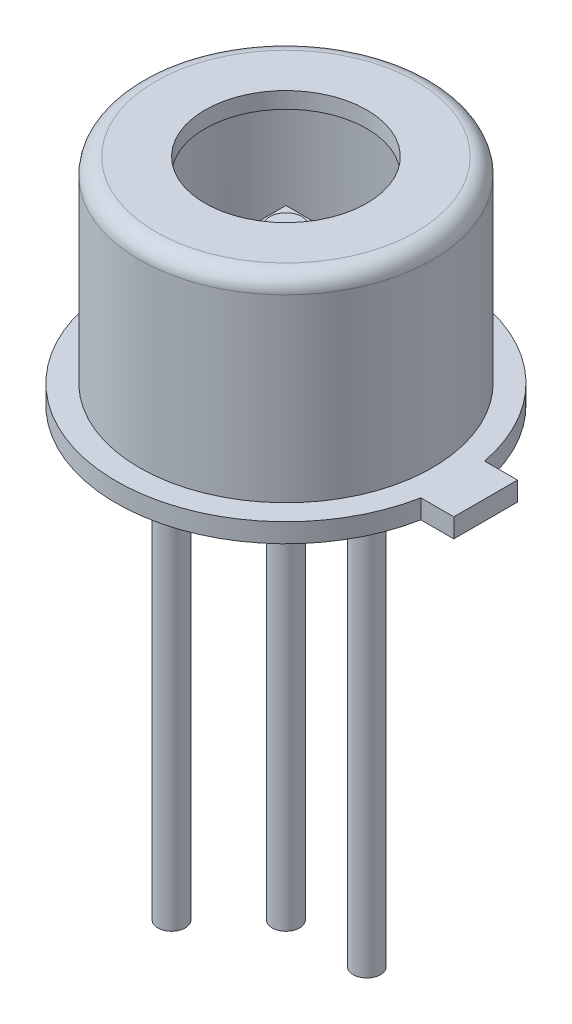
ISO-10303-21;
HEADER;
FILE_DESCRIPTION(('STEP AP214'),'2;1');
FILE_NAME('part.step','',(''),(''),'','','');
FILE_SCHEMA(('AUTOMOTIVE_DESIGN { 1 0 10303 214 1 1 1 1 }'));
ENDSEC;
DATA;
#1=APPLICATION_CONTEXT('core data for automotive mechanical design processes');
#2=APPLICATION_PROTOCOL_DEFINITION('international standard','automotive_design',2000,#1);
#3=PRODUCT_CONTEXT('',#1,'mechanical');
#4=PRODUCT('Part','Part','',(#3));
#5=PRODUCT_RELATED_PRODUCT_CATEGORY('part','',(#4));
#6=PRODUCT_DEFINITION_FORMATION('','',#4);
#7=PRODUCT_DEFINITION_CONTEXT('part definition',#1,'design');
#8=PRODUCT_DEFINITION('design','',#6,#7);
#9=PRODUCT_DEFINITION_SHAPE('','',#8);
#10=(LENGTH_UNIT() NAMED_UNIT(*) SI_UNIT(.MILLI.,.METRE.));
#11=(NAMED_UNIT(*) PLANE_ANGLE_UNIT() SI_UNIT($,.RADIAN.));
#12=(NAMED_UNIT(*) SI_UNIT($,.STERADIAN.) SOLID_ANGLE_UNIT());
#13=UNCERTAINTY_MEASURE_WITH_UNIT(LENGTH_MEASURE(1.E-05),#10,'distance_accuracy_value','');
#14=(GEOMETRIC_REPRESENTATION_CONTEXT(3) GLOBAL_UNCERTAINTY_ASSIGNED_CONTEXT((#13)) GLOBAL_UNIT_ASSIGNED_CONTEXT((#10,
#11,#12)) REPRESENTATION_CONTEXT('',''));
#15=CARTESIAN_POINT('',(0.,0.,0.));
#16=DIRECTION('',(0.,0.,1.));
#17=DIRECTION('',(1.,0.,0.));
#18=AXIS2_PLACEMENT_3D('',#15,#16,#17);
#19=CARTESIAN_POINT('',(-0.375,2.34,-0.375));
#20=DIRECTION('',(0.,-1.,0.));
#21=DIRECTION('',(0.,0.,-1.));
#22=AXIS2_PLACEMENT_3D('',#19,#20,#21);
#23=PLANE('',#22);
#24=DIRECTION('',(0.,0.,-1.));
#25=VECTOR('',#24,1.);
#26=CARTESIAN_POINT('',(-0.375,2.34,0.375));
#27=LINE('',#26,#25);
#28=CARTESIAN_POINT('',(-0.375,2.34,0.375));
#29=VERTEX_POINT('',#28);
#30=CARTESIAN_POINT('',(-0.375,2.34,-0.375));
#31=VERTEX_POINT('',#30);
#32=EDGE_CURVE('E111',#29,#31,#27,.T.);
#33=ORIENTED_EDGE('',*,*,#32,.F.);
#34=DIRECTION('',(-1.,0.,0.));
#35=VECTOR('',#34,1.);
#36=CARTESIAN_POINT('',(-0.375,2.34,0.375));
#37=LINE('',#36,#35);
#38=CARTESIAN_POINT('',(0.375,2.34,0.375));
#39=VERTEX_POINT('',#38);
#40=EDGE_CURVE('E84',#39,#29,#37,.T.);
#41=ORIENTED_EDGE('',*,*,#40,.F.);
#42=DIRECTION('',(0.,0.,1.));
#43=VECTOR('',#42,1.);
#44=CARTESIAN_POINT('',(0.375,2.34,0.375));
#45=LINE('',#44,#43);
#46=CARTESIAN_POINT('',(0.375,2.34,-0.375));
#47=VERTEX_POINT('',#46);
#48=EDGE_CURVE('E78',#47,#39,#45,.T.);
#49=ORIENTED_EDGE('',*,*,#48,.F.);
#50=DIRECTION('',(1.,0.,0.));
#51=VECTOR('',#50,1.);
#52=CARTESIAN_POINT('',(-0.375,2.34,-0.375));
#53=LINE('',#52,#51);
#54=EDGE_CURVE('E102',#31,#47,#53,.T.);
#55=ORIENTED_EDGE('',*,*,#54,.F.);
#56=EDGE_LOOP('',(#33,#41,#49,#55));
#57=FACE_BOUND('',#56,.T.);
#58=CARTESIAN_POINT('',(0.,2.34,0.));
#59=DIRECTION('',(0.,-1.,0.));
#60=DIRECTION('',(0.,0.,-1.));
#61=AXIS2_PLACEMENT_3D('',#58,#59,#60);
#62=CIRCLE('',#61,0.25);
#63=CARTESIAN_POINT('',(0.,2.34,-0.25));
#64=VERTEX_POINT('',#63);
#65=EDGE_CURVE('E12',#64,#64,#62,.F.);
#66=ORIENTED_EDGE('',*,*,#65,.F.);
#67=EDGE_LOOP('',(#66));
#68=FACE_BOUND('',#67,.T.);
#69=ADVANCED_FACE('F44',(#57,#68),#23,.F.);
#70=CARTESIAN_POINT('',(-0.375,2.29,0.375));
#71=DIRECTION('',(1.,0.,0.));
#72=DIRECTION('',(0.,0.,-1.));
#73=AXIS2_PLACEMENT_3D('',#70,#71,#72);
#74=PLANE('',#73);
#75=ORIENTED_EDGE('',*,*,#32,.T.);
#76=DIRECTION('',(0.,1.,0.));
#77=VECTOR('',#76,1.);
#78=CARTESIAN_POINT('',(-0.375,2.29,-0.375));
#79=LINE('',#78,#77);
#80=CARTESIAN_POINT('',(-0.375,2.29,-0.375));
#81=VERTEX_POINT('',#80);
#82=EDGE_CURVE('E53',#81,#31,#79,.T.);
#83=ORIENTED_EDGE('',*,*,#82,.F.);
#84=DIRECTION('',(0.,0.,-1.));
#85=VECTOR('',#84,1.);
#86=CARTESIAN_POINT('',(-0.375,2.29,0.375));
#87=LINE('',#86,#85);
#88=CARTESIAN_POINT('',(-0.375,2.29,0.375));
#89=VERTEX_POINT('',#88);
#90=EDGE_CURVE('E97',#89,#81,#87,.T.);
#91=ORIENTED_EDGE('',*,*,#90,.F.);
#92=DIRECTION('',(0.,1.,0.));
#93=VECTOR('',#92,1.);
#94=CARTESIAN_POINT('',(-0.375,2.29,0.375));
#95=LINE('',#94,#93);
#96=EDGE_CURVE('E107',#89,#29,#95,.T.);
#97=ORIENTED_EDGE('',*,*,#96,.T.);
#98=EDGE_LOOP('',(#75,#83,#91,#97));
#99=FACE_BOUND('',#98,.T.);
#100=ADVANCED_FACE('F46',(#99),#74,.F.);
#101=CARTESIAN_POINT('',(-0.375,2.29,-0.375));
#102=DIRECTION('',(0.,0.,1.));
#103=DIRECTION('',(1.,0.,0.));
#104=AXIS2_PLACEMENT_3D('',#101,#102,#103);
#105=PLANE('',#104);
#106=ORIENTED_EDGE('',*,*,#54,.T.);
#107=DIRECTION('',(0.,1.,0.));
#108=VECTOR('',#107,1.);
#109=CARTESIAN_POINT('',(0.375,2.29,-0.375));
#110=LINE('',#109,#108);
#111=CARTESIAN_POINT('',(0.375,2.29,-0.375));
#112=VERTEX_POINT('',#111);
#113=EDGE_CURVE('E100',#112,#47,#110,.T.);
#114=ORIENTED_EDGE('',*,*,#113,.F.);
#115=DIRECTION('',(1.,0.,0.));
#116=VECTOR('',#115,1.);
#117=CARTESIAN_POINT('',(-0.375,2.29,-0.375));
#118=LINE('',#117,#116);
#119=EDGE_CURVE('E92',#81,#112,#118,.T.);
#120=ORIENTED_EDGE('',*,*,#119,.F.);
#121=ORIENTED_EDGE('',*,*,#82,.T.);
#122=EDGE_LOOP('',(#106,#114,#120,#121));
#123=FACE_BOUND('',#122,.T.);
#124=ADVANCED_FACE('F101',(#123),#105,.F.);
#125=CARTESIAN_POINT('',(0.375,2.29,0.375));
#126=DIRECTION('',(-1.,0.,0.));
#127=DIRECTION('',(0.,0.,1.));
#128=AXIS2_PLACEMENT_3D('',#125,#126,#127);
#129=PLANE('',#128);
#130=ORIENTED_EDGE('',*,*,#48,.T.);
#131=DIRECTION('',(0.,1.,0.));
#132=VECTOR('',#131,1.);
#133=CARTESIAN_POINT('',(0.375,2.29,0.375));
#134=LINE('',#133,#132);
#135=CARTESIAN_POINT('',(0.375,2.29,0.375));
#136=VERTEX_POINT('',#135);
#137=EDGE_CURVE('E103',#136,#39,#134,.T.);
#138=ORIENTED_EDGE('',*,*,#137,.F.);
#139=DIRECTION('',(0.,0.,1.));
#140=VECTOR('',#139,1.);
#141=CARTESIAN_POINT('',(0.375,2.29,0.375));
#142=LINE('',#141,#140);
#143=EDGE_CURVE('E95',#112,#136,#142,.T.);
#144=ORIENTED_EDGE('',*,*,#143,.F.);
#145=ORIENTED_EDGE('',*,*,#113,.T.);
#146=EDGE_LOOP('',(#130,#138,#144,#145));
#147=FACE_BOUND('',#146,.T.);
#148=ADVANCED_FACE('F105',(#147),#129,.F.);
#149=CARTESIAN_POINT('',(-0.375,2.29,0.375));
#150=DIRECTION('',(0.,0.,-1.));
#151=DIRECTION('',(-1.,0.,0.));
#152=AXIS2_PLACEMENT_3D('',#149,#150,#151);
#153=PLANE('',#152);
#154=ORIENTED_EDGE('',*,*,#40,.T.);
#155=ORIENTED_EDGE('',*,*,#96,.F.);
#156=DIRECTION('',(-1.,0.,0.));
#157=VECTOR('',#156,1.);
#158=CARTESIAN_POINT('',(-0.375,2.29,0.375));
#159=LINE('',#158,#157);
#160=EDGE_CURVE('E61',#136,#89,#159,.T.);
#161=ORIENTED_EDGE('',*,*,#160,.F.);
#162=ORIENTED_EDGE('',*,*,#137,.T.);
#163=EDGE_LOOP('',(#154,#155,#161,#162));
#164=FACE_BOUND('',#163,.T.);
#165=ADVANCED_FACE('F138',(#164),#153,.F.);
#166=CARTESIAN_POINT('',(-0.375,2.29,-0.375));
#167=DIRECTION('',(0.,-1.,0.));
#168=DIRECTION('',(0.,0.,-1.));
#169=AXIS2_PLACEMENT_3D('',#166,#167,#168);
#170=PLANE('',#169);
#171=ORIENTED_EDGE('',*,*,#90,.T.);
#172=ORIENTED_EDGE('',*,*,#119,.T.);
#173=ORIENTED_EDGE('',*,*,#143,.T.);
#174=ORIENTED_EDGE('',*,*,#160,.T.);
#175=EDGE_LOOP('',(#171,#172,#173,#174));
#176=FACE_BOUND('',#175,.T.);
#177=ADVANCED_FACE('F93',(#176),#170,.T.);
#178=CARTESIAN_POINT('',(0.,2.44,0.));
#179=DIRECTION('',(0.,-1.,0.));
#180=DIRECTION('',(0.,0.,-1.));
#181=AXIS2_PLACEMENT_3D('',#178,#179,#180);
#182=CYLINDRICAL_SURFACE('',#181,0.25);
#183=CARTESIAN_POINT('',(0.,2.44,0.));
#184=DIRECTION('',(0.,1.,0.));
#185=DIRECTION('',(0.,0.,1.));
#186=AXIS2_PLACEMENT_3D('',#183,#184,#185);
#187=CIRCLE('',#186,0.25);
#188=CARTESIAN_POINT('',(0.,2.44,0.25));
#189=VERTEX_POINT('',#188);
#190=EDGE_CURVE('E114',#189,#189,#187,.T.);
#191=ORIENTED_EDGE('',*,*,#190,.F.);
#192=EDGE_LOOP('',(#191));
#193=FACE_BOUND('',#192,.T.);
#194=ORIENTED_EDGE('',*,*,#65,.T.);
#195=EDGE_LOOP('',(#194));
#196=FACE_BOUND('',#195,.T.);
#197=ADVANCED_FACE('F127',(#193,#196),#182,.T.);
#198=CARTESIAN_POINT('',(0.,2.44,0.));
#199=DIRECTION('',(0.,1.,0.));
#200=DIRECTION('',(0.,0.,1.));
#201=AXIS2_PLACEMENT_3D('',#198,#199,#200);
#202=PLANE('',#201);
#203=ORIENTED_EDGE('',*,*,#190,.T.);
#204=EDGE_LOOP('',(#203));
#205=FACE_BOUND('',#204,.T.);
#206=ADVANCED_FACE('F129',(#205),#202,.T.);
#207=CLOSED_SHELL('',(#69,#100,#124,#148,#165,#177,#197,#206));
#208=MANIFOLD_SOLID_BREP('B2',#207);
#209=CARTESIAN_POINT('',(2.665,0.,0.));
#210=DIRECTION('',(0.,1.,0.));
#211=DIRECTION('',(0.,0.,1.));
#212=AXIS2_PLACEMENT_3D('',#209,#210,#211);
#213=PLANE('',#212);
#214=CARTESIAN_POINT('',(0.,0.,0.));
#215=DIRECTION('',(0.,1.,0.));
#216=DIRECTION('',(0.,0.,1.));
#217=AXIS2_PLACEMENT_3D('',#214,#215,#216);
#218=CIRCLE('',#217,0.215);
#219=CARTESIAN_POINT('',(0.,0.,0.215));
#220=VERTEX_POINT('',#219);
#221=EDGE_CURVE('E312',#220,#220,#218,.F.);
#222=ORIENTED_EDGE('',*,*,#221,.F.);
#223=EDGE_LOOP('',(#222));
#224=FACE_BOUND('',#223,.T.);
#225=CARTESIAN_POINT('',(0.,0.,0.));
#226=DIRECTION('',(0.,-1.,0.));
#227=DIRECTION('',(0.,0.,-1.));
#228=AXIS2_PLACEMENT_3D('',#225,#226,#227);
#229=CIRCLE('',#228,2.665);
#230=CARTESIAN_POINT('',(2.61767549554944,0.,0.5));
#231=VERTEX_POINT('',#230);
#232=CARTESIAN_POINT('',(2.61767549554944,0.,-0.5));
#233=VERTEX_POINT('',#232);
#234=EDGE_CURVE('E301',#231,#233,#229,.T.);
#235=ORIENTED_EDGE('',*,*,#234,.T.);
#236=DIRECTION('',(1.,0.,0.));
#237=VECTOR('',#236,1.);
#238=CARTESIAN_POINT('',(3.135,0.,-0.5));
#239=LINE('',#238,#237);
#240=CARTESIAN_POINT('',(3.135,0.,-0.5));
#241=VERTEX_POINT('',#240);
#242=EDGE_CURVE('E267',#233,#241,#239,.T.);
#243=ORIENTED_EDGE('',*,*,#242,.T.);
#244=DIRECTION('',(0.,0.,1.));
#245=VECTOR('',#244,1.);
#246=CARTESIAN_POINT('',(3.135,0.,-0.5));
#247=LINE('',#246,#245);
#248=CARTESIAN_POINT('',(3.135,0.,0.5));
#249=VERTEX_POINT('',#248);
#250=EDGE_CURVE('E252',#241,#249,#247,.T.);
#251=ORIENTED_EDGE('',*,*,#250,.T.);
#252=DIRECTION('',(-1.,0.,0.));
#253=VECTOR('',#252,1.);
#254=CARTESIAN_POINT('',(3.135,0.,0.5));
#255=LINE('',#254,#253);
#256=EDGE_CURVE('E214',#249,#231,#255,.T.);
#257=ORIENTED_EDGE('',*,*,#256,.T.);
#258=EDGE_LOOP('',(#235,#243,#251,#257));
#259=FACE_BOUND('',#258,.T.);
#260=CARTESIAN_POINT('',(1.27,0.,0.));
#261=DIRECTION('',(0.,1.,0.));
#262=DIRECTION('',(0.,0.,1.));
#263=AXIS2_PLACEMENT_3D('',#260,#261,#262);
#264=CIRCLE('',#263,0.215);
#265=CARTESIAN_POINT('',(1.27,0.,0.215));
#266=VERTEX_POINT('',#265);
#267=EDGE_CURVE('E207',#266,#266,#264,.F.);
#268=ORIENTED_EDGE('',*,*,#267,.F.);
#269=EDGE_LOOP('',(#268));
#270=FACE_BOUND('',#269,.T.);
#271=CARTESIAN_POINT('',(-0.89802561210692,0.,0.898025612106911));
#272=DIRECTION('',(0.,1.,0.));
#273=DIRECTION('',(0.,0.,1.));
#274=AXIS2_PLACEMENT_3D('',#271,#272,#273);
#275=CIRCLE('',#274,0.275);
#276=CARTESIAN_POINT('',(-0.89802561210692,0.,1.17302561210691));
#277=VERTEX_POINT('',#276);
#278=EDGE_CURVE('E42',#277,#277,#275,.F.);
#279=ORIENTED_EDGE('',*,*,#278,.F.);
#280=EDGE_LOOP('',(#279));
#281=FACE_BOUND('',#280,.T.);
#282=ADVANCED_FACE('F199',(#224,#259,#270,#281),#213,.F.);
#283=CARTESIAN_POINT('',(2.046,3.38,0.));
#284=DIRECTION('',(0.,1.,0.));
#285=DIRECTION('',(0.,0.,1.));
#286=AXIS2_PLACEMENT_3D('',#283,#284,#285);
#287=PLANE('',#286);
#288=CARTESIAN_POINT('',(0.,3.38,0.));
#289=DIRECTION('',(0.,-1.,0.));
#290=DIRECTION('',(0.,0.,-1.));
#291=AXIS2_PLACEMENT_3D('',#288,#289,#290);
#292=CIRCLE('',#291,1.27);
#293=CARTESIAN_POINT('',(0.,3.38,-1.27));
#294=VERTEX_POINT('',#293);
#295=EDGE_CURVE('E309',#294,#294,#292,.T.);
#296=ORIENTED_EDGE('',*,*,#295,.T.);
#297=EDGE_LOOP('',(#296));
#298=FACE_BOUND('',#297,.T.);
#299=CARTESIAN_POINT('',(0.,3.38,0.));
#300=DIRECTION('',(0.,-1.,0.));
#301=DIRECTION('',(0.,0.,-1.));
#302=AXIS2_PLACEMENT_3D('',#299,#300,#301);
#303=CIRCLE('',#302,2.046);
#304=CARTESIAN_POINT('',(0.,3.38,-2.046));
#305=VERTEX_POINT('',#304);
#306=EDGE_CURVE('E290',#305,#305,#303,.T.);
#307=ORIENTED_EDGE('',*,*,#306,.F.);
#308=EDGE_LOOP('',(#307));
#309=FACE_BOUND('',#308,.T.);
#310=ADVANCED_FACE('F201',(#298,#309),#287,.T.);
#311=CARTESIAN_POINT('',(0.,0.,0.));
#312=DIRECTION('',(0.,-1.,0.));
#313=DIRECTION('',(0.,0.,-1.));
#314=AXIS2_PLACEMENT_3D('',#311,#312,#313);
#315=CYLINDRICAL_SURFACE('',#314,1.27);
#316=ORIENTED_EDGE('',*,*,#295,.F.);
#317=EDGE_LOOP('',(#316));
#318=FACE_BOUND('',#317,.T.);
#319=CARTESIAN_POINT('',(0.,3.126,0.));
#320=DIRECTION('',(0.,-1.,0.));
#321=DIRECTION('',(0.,0.,-1.));
#322=AXIS2_PLACEMENT_3D('',#319,#320,#321);
#323=CIRCLE('',#322,1.27);
#324=CARTESIAN_POINT('',(0.,3.126,-1.27));
#325=VERTEX_POINT('',#324);
#326=EDGE_CURVE('E306',#325,#325,#323,.T.);
#327=ORIENTED_EDGE('',*,*,#326,.T.);
#328=EDGE_LOOP('',(#327));
#329=FACE_BOUND('',#328,.T.);
#330=ADVANCED_FACE('F345',(#318,#329),#315,.F.);
#331=CARTESIAN_POINT('',(2.046,3.126,0.));
#332=DIRECTION('',(0.,1.,0.));
#333=DIRECTION('',(0.,0.,1.));
#334=AXIS2_PLACEMENT_3D('',#331,#332,#333);
#335=PLANE('',#334);
#336=ORIENTED_EDGE('',*,*,#326,.F.);
#337=EDGE_LOOP('',(#336));
#338=FACE_BOUND('',#337,.T.);
#339=CARTESIAN_POINT('',(0.,3.126,0.));
#340=DIRECTION('',(0.,-1.,0.));
#341=DIRECTION('',(0.,0.,-1.));
#342=AXIS2_PLACEMENT_3D('',#339,#340,#341);
#343=CIRCLE('',#342,2.046);
#344=CARTESIAN_POINT('',(0.,3.126,-2.046));
#345=VERTEX_POINT('',#344);
#346=EDGE_CURVE('E303',#345,#345,#343,.T.);
#347=ORIENTED_EDGE('',*,*,#346,.T.);
#348=EDGE_LOOP('',(#347));
#349=FACE_BOUND('',#348,.T.);
#350=ADVANCED_FACE('F355',(#338,#349),#335,.F.);
#351=CARTESIAN_POINT('',(0.,0.,0.));
#352=DIRECTION('',(0.,-1.,0.));
#353=DIRECTION('',(0.,0.,-1.));
#354=AXIS2_PLACEMENT_3D('',#351,#352,#353);
#355=CYLINDRICAL_SURFACE('',#354,2.046);
#356=ORIENTED_EDGE('',*,*,#346,.F.);
#357=EDGE_LOOP('',(#356));
#358=FACE_BOUND('',#357,.T.);
#359=CARTESIAN_POINT('',(0.,0.0459999999999993,0.));
#360=DIRECTION('',(0.,1.,0.));
#361=DIRECTION('',(0.,0.,1.));
#362=AXIS2_PLACEMENT_3D('',#359,#360,#361);
#363=CIRCLE('',#362,2.046);
#364=CARTESIAN_POINT('',(0.,0.0459999999999993,2.046));
#365=VERTEX_POINT('',#364);
#366=EDGE_CURVE('E287',#365,#365,#363,.F.);
#367=ORIENTED_EDGE('',*,*,#366,.T.);
#368=EDGE_LOOP('',(#367));
#369=FACE_BOUND('',#368,.T.);
#370=ADVANCED_FACE('F352',(#358,#369),#355,.F.);
#371=CARTESIAN_POINT('',(0.,0.,0.));
#372=DIRECTION('',(0.,-1.,0.));
#373=DIRECTION('',(0.,0.,-1.));
#374=AXIS2_PLACEMENT_3D('',#371,#372,#373);
#375=CYLINDRICAL_SURFACE('',#374,2.665);
#376=DIRECTION('',(0.,-1.,0.));
#377=VECTOR('',#376,1.);
#378=CARTESIAN_POINT('',(2.61767549554944,0.3,0.5));
#379=LINE('',#378,#377);
#380=CARTESIAN_POINT('',(2.61767549554944,0.3,0.5));
#381=VERTEX_POINT('',#380);
#382=EDGE_CURVE('E270',#381,#231,#379,.T.);
#383=ORIENTED_EDGE('',*,*,#382,.F.);
#384=CARTESIAN_POINT('',(0.,0.3,0.));
#385=DIRECTION('',(0.,-1.,0.));
#386=DIRECTION('',(0.,0.,-1.));
#387=AXIS2_PLACEMENT_3D('',#384,#385,#386);
#388=CIRCLE('',#387,2.665);
#389=CARTESIAN_POINT('',(2.61767549554944,0.3,-0.5));
#390=VERTEX_POINT('',#389);
#391=EDGE_CURVE('E299',#381,#390,#388,.T.);
#392=ORIENTED_EDGE('',*,*,#391,.T.);
#393=DIRECTION('',(0.,-1.,0.));
#394=VECTOR('',#393,1.);
#395=CARTESIAN_POINT('',(2.61767549554944,0.3,-0.5));
#396=LINE('',#395,#394);
#397=EDGE_CURVE('E245',#390,#233,#396,.T.);
#398=ORIENTED_EDGE('',*,*,#397,.T.);
#399=ORIENTED_EDGE('',*,*,#234,.F.);
#400=EDGE_LOOP('',(#383,#392,#398,#399));
#401=FACE_BOUND('',#400,.T.);
#402=ADVANCED_FACE('F350',(#401),#375,.T.);
#403=CARTESIAN_POINT('',(2.665,0.3,0.));
#404=DIRECTION('',(0.,1.,0.));
#405=DIRECTION('',(0.,0.,1.));
#406=AXIS2_PLACEMENT_3D('',#403,#404,#405);
#407=PLANE('',#406);
#408=ORIENTED_EDGE('',*,*,#391,.F.);
#409=DIRECTION('',(-1.,0.,0.));
#410=VECTOR('',#409,1.);
#411=CARTESIAN_POINT('',(3.135,0.3,0.5));
#412=LINE('',#411,#410);
#413=CARTESIAN_POINT('',(3.135,0.3,0.5));
#414=VERTEX_POINT('',#413);
#415=EDGE_CURVE('E222',#414,#381,#412,.T.);
#416=ORIENTED_EDGE('',*,*,#415,.F.);
#417=DIRECTION('',(0.,0.,1.));
#418=VECTOR('',#417,1.);
#419=CARTESIAN_POINT('',(3.135,0.3,-0.5));
#420=LINE('',#419,#418);
#421=CARTESIAN_POINT('',(3.135,0.3,-0.5));
#422=VERTEX_POINT('',#421);
#423=EDGE_CURVE('E251',#422,#414,#420,.T.);
#424=ORIENTED_EDGE('',*,*,#423,.F.);
#425=DIRECTION('',(1.,0.,0.));
#426=VECTOR('',#425,1.);
#427=CARTESIAN_POINT('',(3.135,0.3,-0.5));
#428=LINE('',#427,#426);
#429=EDGE_CURVE('E259',#390,#422,#428,.T.);
#430=ORIENTED_EDGE('',*,*,#429,.F.);
#431=EDGE_LOOP('',(#408,#416,#424,#430));
#432=FACE_BOUND('',#431,.T.);
#433=CARTESIAN_POINT('',(0.,0.299999999999999,0.));
#434=DIRECTION('',(0.,-1.,0.));
#435=DIRECTION('',(0.,0.,-1.));
#436=AXIS2_PLACEMENT_3D('',#433,#434,#435);
#437=CIRCLE('',#436,2.3);
#438=CARTESIAN_POINT('',(0.,0.299999999999999,-2.3));
#439=VERTEX_POINT('',#438);
#440=EDGE_CURVE('E296',#439,#439,#437,.T.);
#441=ORIENTED_EDGE('',*,*,#440,.T.);
#442=EDGE_LOOP('',(#441));
#443=FACE_BOUND('',#442,.T.);
#444=ADVANCED_FACE('F257',(#432,#443),#407,.T.);
#445=CARTESIAN_POINT('',(0.,0.,0.));
#446=DIRECTION('',(0.,-1.,0.));
#447=DIRECTION('',(0.,0.,-1.));
#448=AXIS2_PLACEMENT_3D('',#445,#446,#447);
#449=CYLINDRICAL_SURFACE('',#448,2.3);
#450=CARTESIAN_POINT('',(0.,3.126,0.));
#451=DIRECTION('',(0.,-1.,0.));
#452=DIRECTION('',(0.,0.,-1.));
#453=AXIS2_PLACEMENT_3D('',#450,#451,#452);
#454=CIRCLE('',#453,2.3);
#455=CARTESIAN_POINT('',(0.,3.126,-2.3));
#456=VERTEX_POINT('',#455);
#457=EDGE_CURVE('E293',#456,#456,#454,.T.);
#458=ORIENTED_EDGE('',*,*,#457,.T.);
#459=EDGE_LOOP('',(#458));
#460=FACE_BOUND('',#459,.T.);
#461=ORIENTED_EDGE('',*,*,#440,.F.);
#462=EDGE_LOOP('',(#461));
#463=FACE_BOUND('',#462,.T.);
#464=ADVANCED_FACE('F383',(#460,#463),#449,.T.);
#465=CARTESIAN_POINT('',(0.,3.126,0.));
#466=DIRECTION('',(0.,-1.,0.));
#467=DIRECTION('',(0.,0.,-1.));
#468=AXIS2_PLACEMENT_3D('',#465,#466,#467);
#469=TOROIDAL_SURFACE('',#468,2.046,0.254);
#470=ORIENTED_EDGE('',*,*,#306,.T.);
#471=EDGE_LOOP('',(#470));
#472=FACE_BOUND('',#471,.T.);
#473=ORIENTED_EDGE('',*,*,#457,.F.);
#474=EDGE_LOOP('',(#473));
#475=FACE_BOUND('',#474,.T.);
#476=ADVANCED_FACE('F374',(#472,#475),#469,.T.);
#477=CARTESIAN_POINT('',(2.665,0.0459999999999993,0.));
#478=DIRECTION('',(0.,1.,0.));
#479=DIRECTION('',(0.,0.,1.));
#480=AXIS2_PLACEMENT_3D('',#477,#478,#479);
#481=PLANE('',#480);
#482=ORIENTED_EDGE('',*,*,#366,.F.);
#483=EDGE_LOOP('',(#482));
#484=FACE_BOUND('',#483,.T.);
#485=ADVANCED_FACE('F371',(#484),#481,.T.);
#486=CARTESIAN_POINT('',(0.,-7.,0.));
#487=DIRECTION('',(0.,1.,0.));
#488=DIRECTION('',(0.,0.,1.));
#489=AXIS2_PLACEMENT_3D('',#486,#487,#488);
#490=CYLINDRICAL_SURFACE('',#489,0.215);
#491=CARTESIAN_POINT('',(0.,-7.,0.));
#492=DIRECTION('',(0.,-1.,0.));
#493=DIRECTION('',(0.,0.,1.));
#494=AXIS2_PLACEMENT_3D('',#491,#492,#493);
#495=CIRCLE('',#494,0.215);
#496=CARTESIAN_POINT('',(0.,-7.,0.215));
#497=VERTEX_POINT('',#496);
#498=EDGE_CURVE('E284',#497,#497,#495,.T.);
#499=ORIENTED_EDGE('',*,*,#498,.F.);
#500=EDGE_LOOP('',(#499));
#501=FACE_BOUND('',#500,.T.);
#502=ORIENTED_EDGE('',*,*,#221,.T.);
#503=EDGE_LOOP('',(#502));
#504=FACE_BOUND('',#503,.T.);
#505=ADVANCED_FACE('F373',(#501,#504),#490,.T.);
#506=CARTESIAN_POINT('',(0.,-7.,0.));
#507=DIRECTION('',(0.,1.,0.));
#508=DIRECTION('',(0.,0.,1.));
#509=AXIS2_PLACEMENT_3D('',#506,#507,#508);
#510=PLANE('',#509);
#511=ORIENTED_EDGE('',*,*,#498,.T.);
#512=EDGE_LOOP('',(#511));
#513=FACE_BOUND('',#512,.T.);
#514=ADVANCED_FACE('F380',(#513),#510,.F.);
#515=CARTESIAN_POINT('',(1.27,-7.,0.));
#516=DIRECTION('',(0.,1.,0.));
#517=DIRECTION('',(0.,0.,1.));
#518=AXIS2_PLACEMENT_3D('',#515,#516,#517);
#519=CYLINDRICAL_SURFACE('',#518,0.215);
#520=CARTESIAN_POINT('',(1.27,-7.,0.));
#521=DIRECTION('',(0.,-1.,0.));
#522=DIRECTION('',(0.,0.,1.));
#523=AXIS2_PLACEMENT_3D('',#520,#521,#522);
#524=CIRCLE('',#523,0.215);
#525=CARTESIAN_POINT('',(1.27,-7.,0.215));
#526=VERTEX_POINT('',#525);
#527=EDGE_CURVE('E281',#526,#526,#524,.T.);
#528=ORIENTED_EDGE('',*,*,#527,.F.);
#529=EDGE_LOOP('',(#528));
#530=FACE_BOUND('',#529,.T.);
#531=ORIENTED_EDGE('',*,*,#267,.T.);
#532=EDGE_LOOP('',(#531));
#533=FACE_BOUND('',#532,.T.);
#534=ADVANCED_FACE('F335',(#530,#533),#519,.T.);
#535=CARTESIAN_POINT('',(1.27,-7.,0.));
#536=DIRECTION('',(0.,1.,0.));
#537=DIRECTION('',(0.,0.,1.));
#538=AXIS2_PLACEMENT_3D('',#535,#536,#537);
#539=PLANE('',#538);
#540=ORIENTED_EDGE('',*,*,#527,.T.);
#541=EDGE_LOOP('',(#540));
#542=FACE_BOUND('',#541,.T.);
#543=ADVANCED_FACE('F325',(#542),#539,.F.);
#544=CARTESIAN_POINT('',(-0.89802561210692,-0.2,0.898025612106911));
#545=DIRECTION('',(0.,-1.,0.));
#546=DIRECTION('',(0.,0.,-1.));
#547=AXIS2_PLACEMENT_3D('',#544,#545,#546);
#548=PLANE('',#547);
#549=CARTESIAN_POINT('',(-0.89802561210692,-0.2,0.898025612106911));
#550=DIRECTION('',(0.,-1.,0.));
#551=DIRECTION('',(0.,0.,-1.));
#552=AXIS2_PLACEMENT_3D('',#549,#550,#551);
#553=CIRCLE('',#552,0.275);
#554=CARTESIAN_POINT('',(-0.89802561210692,-0.2,0.62302561210691));
#555=VERTEX_POINT('',#554);
#556=EDGE_CURVE('E272',#555,#555,#553,.T.);
#557=ORIENTED_EDGE('',*,*,#556,.T.);
#558=EDGE_LOOP('',(#557));
#559=FACE_BOUND('',#558,.T.);
#560=CARTESIAN_POINT('',(-0.89802561210692,-0.2,0.89802561210691));
#561=DIRECTION('',(0.,-1.,0.));
#562=DIRECTION('',(0.,0.,-1.));
#563=AXIS2_PLACEMENT_3D('',#560,#561,#562);
#564=CIRCLE('',#563,0.215);
#565=CARTESIAN_POINT('',(-0.89802561210692,-0.2,0.683025612106911));
#566=VERTEX_POINT('',#565);
#567=EDGE_CURVE('E277',#566,#566,#564,.T.);
#568=ORIENTED_EDGE('',*,*,#567,.F.);
#569=EDGE_LOOP('',(#568));
#570=FACE_BOUND('',#569,.T.);
#571=ADVANCED_FACE('F322',(#559,#570),#548,.T.);
#572=CARTESIAN_POINT('',(-0.89802561210692,-0.2,0.898025612106911));
#573=DIRECTION('',(0.,1.,0.));
#574=DIRECTION('',(0.,0.,1.));
#575=AXIS2_PLACEMENT_3D('',#572,#573,#574);
#576=CYLINDRICAL_SURFACE('',#575,0.275);
#577=ORIENTED_EDGE('',*,*,#556,.F.);
#578=EDGE_LOOP('',(#577));
#579=FACE_BOUND('',#578,.T.);
#580=ORIENTED_EDGE('',*,*,#278,.T.);
#581=EDGE_LOOP('',(#580));
#582=FACE_BOUND('',#581,.T.);
#583=ADVANCED_FACE('F324',(#579,#582),#576,.T.);
#584=CARTESIAN_POINT('',(-0.89802561210692,-7.,0.89802561210691));
#585=DIRECTION('',(0.,-1.,0.));
#586=DIRECTION('',(0.,0.,-1.));
#587=AXIS2_PLACEMENT_3D('',#584,#585,#586);
#588=PLANE('',#587);
#589=CARTESIAN_POINT('',(-0.89802561210692,-7.,0.89802561210691));
#590=DIRECTION('',(0.,-1.,0.));
#591=DIRECTION('',(0.,0.,-1.));
#592=AXIS2_PLACEMENT_3D('',#589,#590,#591);
#593=CIRCLE('',#592,0.215);
#594=CARTESIAN_POINT('',(-0.89802561210692,-7.,0.683025612106911));
#595=VERTEX_POINT('',#594);
#596=EDGE_CURVE('E278',#595,#595,#593,.T.);
#597=ORIENTED_EDGE('',*,*,#596,.T.);
#598=EDGE_LOOP('',(#597));
#599=FACE_BOUND('',#598,.T.);
#600=ADVANCED_FACE('F332',(#599),#588,.T.);
#601=CARTESIAN_POINT('',(-0.89802561210692,-7.,0.89802561210691));
#602=DIRECTION('',(0.,1.,0.));
#603=DIRECTION('',(0.,0.,1.));
#604=AXIS2_PLACEMENT_3D('',#601,#602,#603);
#605=CYLINDRICAL_SURFACE('',#604,0.215);
#606=ORIENTED_EDGE('',*,*,#567,.T.);
#607=EDGE_LOOP('',(#606));
#608=FACE_BOUND('',#607,.T.);
#609=ORIENTED_EDGE('',*,*,#596,.F.);
#610=EDGE_LOOP('',(#609));
#611=FACE_BOUND('',#610,.T.);
#612=ADVANCED_FACE('F319',(#608,#611),#605,.T.);
#613=CARTESIAN_POINT('',(3.135,0.3,0.5));
#614=DIRECTION('',(0.,0.,1.));
#615=DIRECTION('',(1.,0.,0.));
#616=AXIS2_PLACEMENT_3D('',#613,#614,#615);
#617=PLANE('',#616);
#618=ORIENTED_EDGE('',*,*,#256,.F.);
#619=DIRECTION('',(0.,-1.,0.));
#620=VECTOR('',#619,1.);
#621=CARTESIAN_POINT('',(3.135,0.3,0.5));
#622=LINE('',#621,#620);
#623=EDGE_CURVE('E239',#414,#249,#622,.T.);
#624=ORIENTED_EDGE('',*,*,#623,.F.);
#625=ORIENTED_EDGE('',*,*,#415,.T.);
#626=ORIENTED_EDGE('',*,*,#382,.T.);
#627=EDGE_LOOP('',(#618,#624,#625,#626));
#628=FACE_BOUND('',#627,.T.);
#629=ADVANCED_FACE('F398',(#628),#617,.T.);
#630=CARTESIAN_POINT('',(3.135,0.3,-0.5));
#631=DIRECTION('',(1.,0.,0.));
#632=DIRECTION('',(0.,0.,-1.));
#633=AXIS2_PLACEMENT_3D('',#630,#631,#632);
#634=PLANE('',#633);
#635=ORIENTED_EDGE('',*,*,#250,.F.);
#636=DIRECTION('',(0.,-1.,0.));
#637=VECTOR('',#636,1.);
#638=CARTESIAN_POINT('',(3.135,0.3,-0.5));
#639=LINE('',#638,#637);
#640=EDGE_CURVE('E248',#422,#241,#639,.T.);
#641=ORIENTED_EDGE('',*,*,#640,.F.);
#642=ORIENTED_EDGE('',*,*,#423,.T.);
#643=ORIENTED_EDGE('',*,*,#623,.T.);
#644=EDGE_LOOP('',(#635,#641,#642,#643));
#645=FACE_BOUND('',#644,.T.);
#646=ADVANCED_FACE('F250',(#645),#634,.T.);
#647=CARTESIAN_POINT('',(3.135,0.3,-0.5));
#648=DIRECTION('',(0.,0.,-1.));
#649=DIRECTION('',(-1.,0.,0.));
#650=AXIS2_PLACEMENT_3D('',#647,#648,#649);
#651=PLANE('',#650);
#652=ORIENTED_EDGE('',*,*,#242,.F.);
#653=ORIENTED_EDGE('',*,*,#397,.F.);
#654=ORIENTED_EDGE('',*,*,#429,.T.);
#655=ORIENTED_EDGE('',*,*,#640,.T.);
#656=EDGE_LOOP('',(#652,#653,#654,#655));
#657=FACE_BOUND('',#656,.T.);
#658=ADVANCED_FACE('F262',(#657),#651,.T.);
#659=CLOSED_SHELL('',(#282,#310,#330,#350,#370,#402,#444,#464,#476,#485,#505,#514,#534,#543,
#571,#583,#600,#612,#629,#646,#658));
#660=MANIFOLD_SOLID_BREP('B6',#659);
#661=ADVANCED_BREP_SHAPE_REPRESENTATION('',(#18,#208,#660),#14);
#662=SHAPE_DEFINITION_REPRESENTATION(#9,#661);
ENDSEC;
END-ISO-10303-21;
